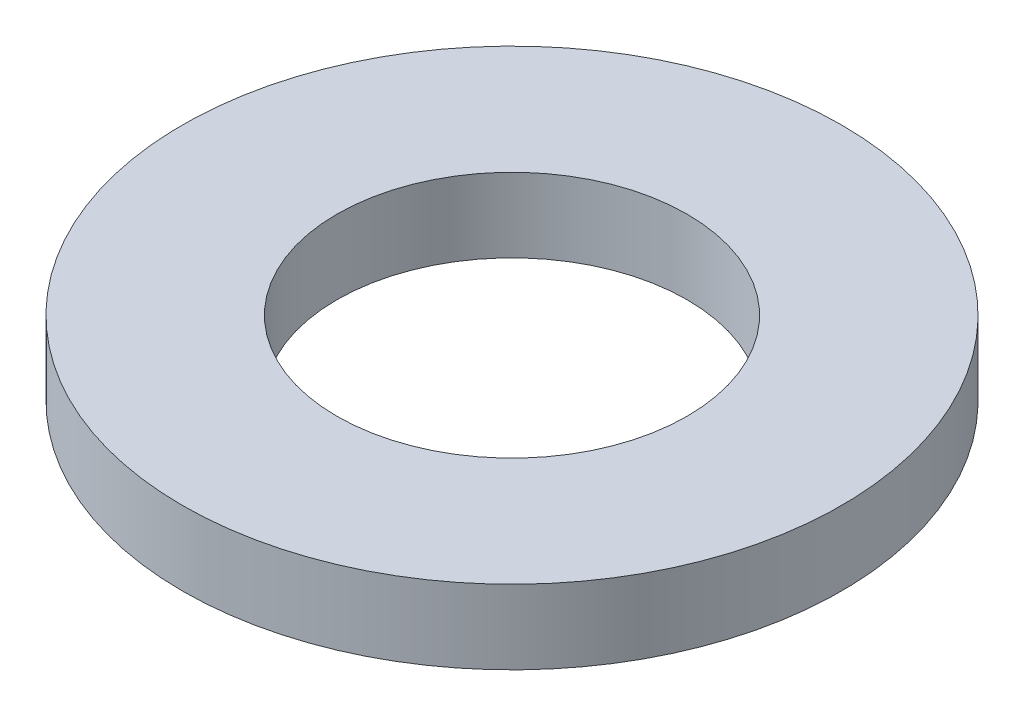
ISO-10303-21;
HEADER;
FILE_DESCRIPTION(('STEP AP214'),'2;1');
FILE_NAME('part.step','',(''),(''),'','','');
FILE_SCHEMA(('AUTOMOTIVE_DESIGN { 1 0 10303 214 1 1 1 1 }'));
ENDSEC;
DATA;
#1=APPLICATION_CONTEXT('core data for automotive mechanical design processes');
#2=APPLICATION_PROTOCOL_DEFINITION('international standard','automotive_design',2000,#1);
#3=PRODUCT_CONTEXT('',#1,'mechanical');
#4=PRODUCT('Part','Part','',(#3));
#5=PRODUCT_RELATED_PRODUCT_CATEGORY('part','',(#4));
#6=PRODUCT_DEFINITION_FORMATION('','',#4);
#7=PRODUCT_DEFINITION_CONTEXT('part definition',#1,'design');
#8=PRODUCT_DEFINITION('design','',#6,#7);
#9=PRODUCT_DEFINITION_SHAPE('','',#8);
#10=(LENGTH_UNIT() NAMED_UNIT(*) SI_UNIT(.MILLI.,.METRE.));
#11=(NAMED_UNIT(*) PLANE_ANGLE_UNIT() SI_UNIT($,.RADIAN.));
#12=(NAMED_UNIT(*) SI_UNIT($,.STERADIAN.) SOLID_ANGLE_UNIT());
#13=UNCERTAINTY_MEASURE_WITH_UNIT(LENGTH_MEASURE(1.E-05),#10,'distance_accuracy_value','');
#14=(GEOMETRIC_REPRESENTATION_CONTEXT(3) GLOBAL_UNCERTAINTY_ASSIGNED_CONTEXT((#13)) GLOBAL_UNIT_ASSIGNED_CONTEXT((#10,
#11,#12)) REPRESENTATION_CONTEXT('',''));
#15=CARTESIAN_POINT('',(0.,0.,0.));
#16=DIRECTION('',(0.,0.,1.));
#17=DIRECTION('',(1.,0.,0.));
#18=AXIS2_PLACEMENT_3D('',#15,#16,#17);
#19=CARTESIAN_POINT('',(0.,18.,0.));
#20=DIRECTION('',(0.,-1.,0.));
#21=DIRECTION('',(0.,0.,-1.));
#22=AXIS2_PLACEMENT_3D('',#19,#20,#21);
#23=CYLINDRICAL_SURFACE('',#22,80.);
#24=CARTESIAN_POINT('',(0.,18.,0.));
#25=DIRECTION('',(0.,1.,0.));
#26=DIRECTION('',(0.,0.,1.));
#27=AXIS2_PLACEMENT_3D('',#24,#25,#26);
#28=CIRCLE('',#27,80.);
#29=CARTESIAN_POINT('',(0.,18.,80.));
#30=VERTEX_POINT('',#29);
#31=EDGE_CURVE('E10',#30,#30,#28,.T.);
#32=ORIENTED_EDGE('',*,*,#31,.F.);
#33=EDGE_LOOP('',(#32));
#34=FACE_BOUND('',#33,.T.);
#35=CARTESIAN_POINT('',(0.,0.,0.));
#36=DIRECTION('',(0.,1.,0.));
#37=DIRECTION('',(0.,0.,1.));
#38=AXIS2_PLACEMENT_3D('',#35,#36,#37);
#39=CIRCLE('',#38,80.);
#40=CARTESIAN_POINT('',(0.,0.,80.));
#41=VERTEX_POINT('',#40);
#42=EDGE_CURVE('E37',#41,#41,#39,.T.);
#43=ORIENTED_EDGE('',*,*,#42,.T.);
#44=EDGE_LOOP('',(#43));
#45=FACE_BOUND('',#44,.T.);
#46=ADVANCED_FACE('F40',(#34,#45),#23,.T.);
#47=CARTESIAN_POINT('',(0.,18.,0.));
#48=DIRECTION('',(0.,1.,0.));
#49=DIRECTION('',(0.,0.,1.));
#50=AXIS2_PLACEMENT_3D('',#47,#48,#49);
#51=PLANE('',#50);
#52=CARTESIAN_POINT('',(0.,18.,0.));
#53=DIRECTION('',(0.,1.,0.));
#54=DIRECTION('',(0.,0.,1.));
#55=AXIS2_PLACEMENT_3D('',#52,#53,#54);
#56=CIRCLE('',#55,42.5);
#57=CARTESIAN_POINT('',(0.,18.,42.5));
#58=VERTEX_POINT('',#57);
#59=EDGE_CURVE('E50',#58,#58,#56,.T.);
#60=ORIENTED_EDGE('',*,*,#59,.F.);
#61=EDGE_LOOP('',(#60));
#62=FACE_BOUND('',#61,.T.);
#63=ORIENTED_EDGE('',*,*,#31,.T.);
#64=EDGE_LOOP('',(#63));
#65=FACE_BOUND('',#64,.T.);
#66=ADVANCED_FACE('F59',(#62,#65),#51,.T.);
#67=CARTESIAN_POINT('',(0.,0.,0.));
#68=DIRECTION('',(0.,1.,0.));
#69=DIRECTION('',(0.,0.,1.));
#70=AXIS2_PLACEMENT_3D('',#67,#68,#69);
#71=PLANE('',#70);
#72=CARTESIAN_POINT('',(0.,0.,0.));
#73=DIRECTION('',(0.,1.,0.));
#74=DIRECTION('',(0.,0.,1.));
#75=AXIS2_PLACEMENT_3D('',#72,#73,#74);
#76=CIRCLE('',#75,42.5);
#77=CARTESIAN_POINT('',(0.,0.,42.5));
#78=VERTEX_POINT('',#77);
#79=EDGE_CURVE('E47',#78,#78,#76,.T.);
#80=ORIENTED_EDGE('',*,*,#79,.T.);
#81=EDGE_LOOP('',(#80));
#82=FACE_BOUND('',#81,.T.);
#83=ORIENTED_EDGE('',*,*,#42,.F.);
#84=EDGE_LOOP('',(#83));
#85=FACE_BOUND('',#84,.T.);
#86=ADVANCED_FACE('F58',(#82,#85),#71,.F.);
#87=CARTESIAN_POINT('',(0.,18.,0.));
#88=DIRECTION('',(0.,-1.,0.));
#89=DIRECTION('',(0.,0.,-1.));
#90=AXIS2_PLACEMENT_3D('',#87,#88,#89);
#91=CYLINDRICAL_SURFACE('',#90,42.5);
#92=ORIENTED_EDGE('',*,*,#59,.T.);
#93=EDGE_LOOP('',(#92));
#94=FACE_BOUND('',#93,.T.);
#95=ORIENTED_EDGE('',*,*,#79,.F.);
#96=EDGE_LOOP('',(#95));
#97=FACE_BOUND('',#96,.T.);
#98=ADVANCED_FACE('F54',(#94,#97),#91,.F.);
#99=CLOSED_SHELL('',(#46,#66,#86,#98));
#100=MANIFOLD_SOLID_BREP('B2',#99);
#101=ADVANCED_BREP_SHAPE_REPRESENTATION('',(#18,#100),#14);
#102=SHAPE_DEFINITION_REPRESENTATION(#9,#101);
ENDSEC;
END-ISO-10303-21;
